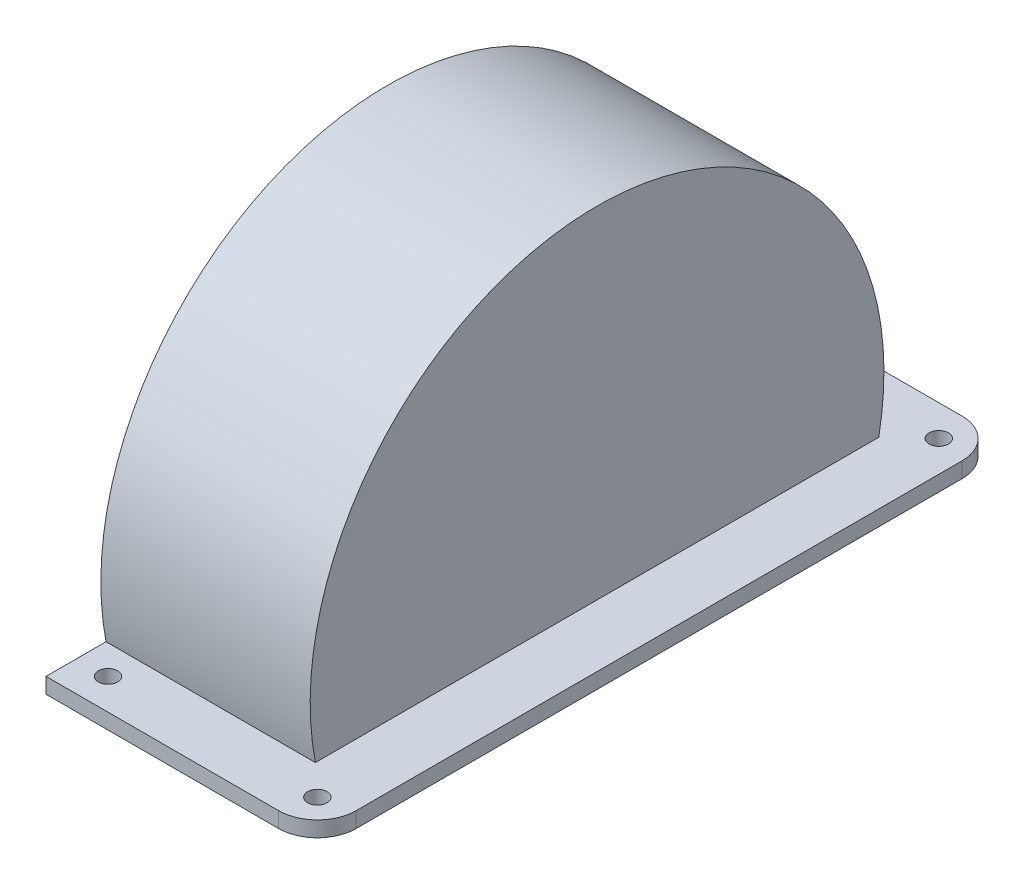
ISO-10303-21;
HEADER;
FILE_DESCRIPTION(('STEP AP214'),'2;1');
FILE_NAME('part.step','',(''),(''),'','','');
FILE_SCHEMA(('AUTOMOTIVE_DESIGN { 1 0 10303 214 1 1 1 1 }'));
ENDSEC;
DATA;
#1=APPLICATION_CONTEXT('core data for automotive mechanical design processes');
#2=APPLICATION_PROTOCOL_DEFINITION('international standard','automotive_design',2000,#1);
#3=PRODUCT_CONTEXT('',#1,'mechanical');
#4=PRODUCT('Part','Part','',(#3));
#5=PRODUCT_RELATED_PRODUCT_CATEGORY('part','',(#4));
#6=PRODUCT_DEFINITION_FORMATION('','',#4);
#7=PRODUCT_DEFINITION_CONTEXT('part definition',#1,'design');
#8=PRODUCT_DEFINITION('design','',#6,#7);
#9=PRODUCT_DEFINITION_SHAPE('','',#8);
#10=(LENGTH_UNIT() NAMED_UNIT(*) SI_UNIT(.MILLI.,.METRE.));
#11=(NAMED_UNIT(*) PLANE_ANGLE_UNIT() SI_UNIT($,.RADIAN.));
#12=(NAMED_UNIT(*) SI_UNIT($,.STERADIAN.) SOLID_ANGLE_UNIT());
#13=UNCERTAINTY_MEASURE_WITH_UNIT(LENGTH_MEASURE(1.E-05),#10,'distance_accuracy_value','');
#14=(GEOMETRIC_REPRESENTATION_CONTEXT(3) GLOBAL_UNCERTAINTY_ASSIGNED_CONTEXT((#13)) GLOBAL_UNIT_ASSIGNED_CONTEXT((#10,
#11,#12)) REPRESENTATION_CONTEXT('',''));
#15=CARTESIAN_POINT('',(0.,0.,0.));
#16=DIRECTION('',(0.,0.,1.));
#17=DIRECTION('',(1.,0.,0.));
#18=AXIS2_PLACEMENT_3D('',#15,#16,#17);
#19=CARTESIAN_POINT('',(14.5,0.,0.));
#20=DIRECTION('',(-1.,0.,0.));
#21=DIRECTION('',(0.,0.,1.));
#22=AXIS2_PLACEMENT_3D('',#19,#20,#21);
#23=CYLINDRICAL_SURFACE('',#22,37.);
#24=DIRECTION('',(-1.,0.,0.));
#25=VECTOR('',#24,1.);
#26=CARTESIAN_POINT('',(14.5,-7.,-36.3318042491699));
#27=LINE('',#26,#25);
#28=CARTESIAN_POINT('',(14.5,-7.,-36.3318042491699));
#29=VERTEX_POINT('',#28);
#30=CARTESIAN_POINT('',(-12.5,-7.00000000000001,-36.3318042491699));
#31=VERTEX_POINT('',#30);
#32=EDGE_CURVE('E224',#29,#31,#27,.T.);
#33=ORIENTED_EDGE('',*,*,#32,.T.);
#34=CARTESIAN_POINT('',(-12.5,0.,0.));
#35=DIRECTION('',(1.,0.,0.));
#36=DIRECTION('',(0.,0.,-1.));
#37=AXIS2_PLACEMENT_3D('',#34,#35,#36);
#38=CIRCLE('',#37,37.);
#39=CARTESIAN_POINT('',(-12.5,-7.,36.3318042491699));
#40=VERTEX_POINT('',#39);
#41=EDGE_CURVE('E308',#31,#40,#38,.T.);
#42=ORIENTED_EDGE('',*,*,#41,.T.);
#43=DIRECTION('',(-1.,0.,0.));
#44=VECTOR('',#43,1.);
#45=CARTESIAN_POINT('',(14.5,-7.,36.3318042491699));
#46=LINE('',#45,#44);
#47=CARTESIAN_POINT('',(14.5,-7.,36.3318042491699));
#48=VERTEX_POINT('',#47);
#49=EDGE_CURVE('E221',#40,#48,#46,.F.);
#50=ORIENTED_EDGE('',*,*,#49,.T.);
#51=CARTESIAN_POINT('',(14.5,0.,0.));
#52=DIRECTION('',(1.,0.,0.));
#53=DIRECTION('',(0.,0.,-1.));
#54=AXIS2_PLACEMENT_3D('',#51,#52,#53);
#55=CIRCLE('',#54,37.);
#56=EDGE_CURVE('E235',#29,#48,#55,.T.);
#57=ORIENTED_EDGE('',*,*,#56,.F.);
#58=EDGE_LOOP('',(#33,#42,#50,#57));
#59=FACE_BOUND('',#58,.T.);
#60=ADVANCED_FACE('F39',(#59),#23,.T.);
#61=CARTESIAN_POINT('',(14.5,0.,0.));
#62=DIRECTION('',(1.,0.,0.));
#63=DIRECTION('',(0.,0.,-1.));
#64=AXIS2_PLACEMENT_3D('',#61,#62,#63);
#65=PLANE('',#64);
#66=DIRECTION('',(0.,0.,1.));
#67=VECTOR('',#66,1.);
#68=CARTESIAN_POINT('',(14.5,-7.,0.));
#69=LINE('',#68,#67);
#70=EDGE_CURVE('E54',#29,#48,#69,.T.);
#71=ORIENTED_EDGE('',*,*,#70,.F.);
#72=ORIENTED_EDGE('',*,*,#56,.T.);
#73=EDGE_LOOP('',(#71,#72));
#74=FACE_BOUND('',#73,.T.);
#75=ADVANCED_FACE('F361',(#74),#65,.T.);
#76=CARTESIAN_POINT('',(17.5,-7.,-39.0734500748016));
#77=DIRECTION('',(0.,1.,0.));
#78=DIRECTION('',(0.,0.,1.));
#79=AXIS2_PLACEMENT_3D('',#76,#77,#78);
#80=PLANE('',#79);
#81=DIRECTION('',(0.,0.,1.));
#82=VECTOR('',#81,1.);
#83=CARTESIAN_POINT('',(-12.5,-7.,44.0734500748016));
#84=LINE('',#83,#82);
#85=CARTESIAN_POINT('',(-12.5,-7.,44.0734500748016));
#86=VERTEX_POINT('',#85);
#87=EDGE_CURVE('E304',#40,#86,#84,.T.);
#88=ORIENTED_EDGE('',*,*,#87,.T.);
#89=DIRECTION('',(-1.,0.,0.));
#90=VECTOR('',#89,1.);
#91=CARTESIAN_POINT('',(-9.49999999999997,-7.,44.0734500748016));
#92=LINE('',#91,#90);
#93=CARTESIAN_POINT('',(17.5,-7.,44.0734500748016));
#94=VERTEX_POINT('',#93);
#95=EDGE_CURVE('E161',#94,#86,#92,.T.);
#96=ORIENTED_EDGE('',*,*,#95,.F.);
#97=CARTESIAN_POINT('',(17.5,-7.,39.0734500748016));
#98=DIRECTION('',(0.,-1.,0.));
#99=DIRECTION('',(0.,0.,1.));
#100=AXIS2_PLACEMENT_3D('',#97,#98,#99);
#101=CIRCLE('',#100,5.);
#102=CARTESIAN_POINT('',(22.5,-7.,39.0734500748016));
#103=VERTEX_POINT('',#102);
#104=EDGE_CURVE('E189',#103,#94,#101,.T.);
#105=ORIENTED_EDGE('',*,*,#104,.F.);
#106=DIRECTION('',(0.,0.,1.));
#107=VECTOR('',#106,1.);
#108=CARTESIAN_POINT('',(22.5,-7.,-39.0734500748016));
#109=LINE('',#108,#107);
#110=CARTESIAN_POINT('',(22.5,-7.,-39.0734500748016));
#111=VERTEX_POINT('',#110);
#112=EDGE_CURVE('E186',#111,#103,#109,.T.);
#113=ORIENTED_EDGE('',*,*,#112,.F.);
#114=CARTESIAN_POINT('',(17.5,-7.,-39.0734500748016));
#115=DIRECTION('',(0.,-1.,0.));
#116=DIRECTION('',(0.,0.,1.));
#117=AXIS2_PLACEMENT_3D('',#114,#115,#116);
#118=CIRCLE('',#117,5.);
#119=CARTESIAN_POINT('',(17.5,-7.,-44.0734500748016));
#120=VERTEX_POINT('',#119);
#121=EDGE_CURVE('E183',#120,#111,#118,.T.);
#122=ORIENTED_EDGE('',*,*,#121,.F.);
#123=DIRECTION('',(1.,0.,0.));
#124=VECTOR('',#123,1.);
#125=CARTESIAN_POINT('',(-9.49999999999997,-7.,-44.0734500748016));
#126=LINE('',#125,#124);
#127=CARTESIAN_POINT('',(-12.5,-7.,-44.0734500748016));
#128=VERTEX_POINT('',#127);
#129=EDGE_CURVE('E180',#128,#120,#126,.T.);
#130=ORIENTED_EDGE('',*,*,#129,.F.);
#131=DIRECTION('',(0.,0.,1.));
#132=VECTOR('',#131,1.);
#133=CARTESIAN_POINT('',(-12.5,-7.,-36.3318042491699));
#134=LINE('',#133,#132);
#135=EDGE_CURVE('E315',#128,#31,#134,.T.);
#136=ORIENTED_EDGE('',*,*,#135,.T.);
#137=ORIENTED_EDGE('',*,*,#32,.F.);
#138=ORIENTED_EDGE('',*,*,#70,.T.);
#139=ORIENTED_EDGE('',*,*,#49,.F.);
#140=EDGE_LOOP('',(#88,#96,#105,#113,#122,#130,#136,#137,#138,#139));
#141=FACE_BOUND('',#140,.T.);
#142=CARTESIAN_POINT('',(-8.50000000000001,-7.,-40.0734500748016));
#143=DIRECTION('',(0.,-1.,0.));
#144=DIRECTION('',(0.,0.,-1.));
#145=AXIS2_PLACEMENT_3D('',#142,#143,#144);
#146=CIRCLE('',#145,1.25);
#147=CARTESIAN_POINT('',(-8.50000000000001,-7.,-41.3234500748016));
#148=VERTEX_POINT('',#147);
#149=EDGE_CURVE('E307',#148,#148,#146,.T.);
#150=ORIENTED_EDGE('',*,*,#149,.T.);
#151=EDGE_LOOP('',(#150));
#152=FACE_BOUND('',#151,.T.);
#153=CARTESIAN_POINT('',(-8.50000000000001,-7.,40.0734500748016));
#154=DIRECTION('',(0.,-1.,0.));
#155=DIRECTION('',(0.,0.,-1.));
#156=AXIS2_PLACEMENT_3D('',#153,#154,#155);
#157=CIRCLE('',#156,1.25);
#158=CARTESIAN_POINT('',(-8.50000000000001,-7.,38.8234500748016));
#159=VERTEX_POINT('',#158);
#160=EDGE_CURVE('E327',#159,#159,#157,.T.);
#161=ORIENTED_EDGE('',*,*,#160,.T.);
#162=EDGE_LOOP('',(#161));
#163=FACE_BOUND('',#162,.T.);
#164=CARTESIAN_POINT('',(18.5,-7.,40.0734500748016));
#165=DIRECTION('',(0.,-1.,0.));
#166=DIRECTION('',(0.,0.,-1.));
#167=AXIS2_PLACEMENT_3D('',#164,#165,#166);
#168=CIRCLE('',#167,1.25);
#169=CARTESIAN_POINT('',(18.5,-7.,38.8234500748016));
#170=VERTEX_POINT('',#169);
#171=EDGE_CURVE('E335',#170,#170,#168,.T.);
#172=ORIENTED_EDGE('',*,*,#171,.T.);
#173=EDGE_LOOP('',(#172));
#174=FACE_BOUND('',#173,.T.);
#175=CARTESIAN_POINT('',(18.5,-7.,-40.0734500748016));
#176=DIRECTION('',(0.,-1.,0.));
#177=DIRECTION('',(0.,0.,-1.));
#178=AXIS2_PLACEMENT_3D('',#175,#176,#177);
#179=CIRCLE('',#178,1.25);
#180=CARTESIAN_POINT('',(18.5,-7.,-41.3234500748016));
#181=VERTEX_POINT('',#180);
#182=EDGE_CURVE('E321',#181,#181,#179,.T.);
#183=ORIENTED_EDGE('',*,*,#182,.T.);
#184=EDGE_LOOP('',(#183));
#185=FACE_BOUND('',#184,.T.);
#186=ADVANCED_FACE('F300',(#141,#152,#163,#174,#185),#80,.T.);
#187=DIRECTION('',(0.,0.,1.));
#188=VECTOR('',#187,1.);
#189=CARTESIAN_POINT('',(12.5,-7.,0.));
#190=LINE('',#189,#188);
#191=CARTESIAN_POINT('',(12.5,-7.,-34.2928563989645));
#192=VERTEX_POINT('',#191);
#193=CARTESIAN_POINT('',(12.5,-7.,-34.0734500748016));
#194=VERTEX_POINT('',#193);
#195=EDGE_CURVE('E215',#192,#194,#190,.T.);
#196=ORIENTED_EDGE('',*,*,#195,.F.);
#197=DIRECTION('',(-1.,0.,0.));
#198=VECTOR('',#197,1.);
#199=CARTESIAN_POINT('',(14.5,-7.,-34.2928563989645));
#200=LINE('',#199,#198);
#201=CARTESIAN_POINT('',(-12.5,-7.,-34.2928563989645));
#202=VERTEX_POINT('',#201);
#203=EDGE_CURVE('E214',#192,#202,#200,.T.);
#204=ORIENTED_EDGE('',*,*,#203,.T.);
#205=DIRECTION('',(0.,0.,1.));
#206=VECTOR('',#205,1.);
#207=CARTESIAN_POINT('',(-12.5,-7.,0.));
#208=LINE('',#207,#206);
#209=CARTESIAN_POINT('',(-12.5,-7.,-34.0734500748016));
#210=VERTEX_POINT('',#209);
#211=EDGE_CURVE('E11',#202,#210,#208,.T.);
#212=ORIENTED_EDGE('',*,*,#211,.T.);
#213=DIRECTION('',(1.,0.,0.));
#214=VECTOR('',#213,1.);
#215=CARTESIAN_POINT('',(-12.5,-7.,-34.0734500748016));
#216=LINE('',#215,#214);
#217=EDGE_CURVE('E265',#210,#194,#216,.T.);
#218=ORIENTED_EDGE('',*,*,#217,.T.);
#219=EDGE_LOOP('',(#196,#204,#212,#218));
#220=FACE_BOUND('',#219,.T.);
#221=ADVANCED_FACE('F264',(#220),#80,.T.);
#222=CARTESIAN_POINT('',(12.5,-7.,34.0734500748016));
#223=VERTEX_POINT('',#222);
#224=CARTESIAN_POINT('',(12.5,-7.,34.2928563989645));
#225=VERTEX_POINT('',#224);
#226=EDGE_CURVE('E211',#223,#225,#190,.T.);
#227=ORIENTED_EDGE('',*,*,#226,.F.);
#228=DIRECTION('',(-1.,0.,0.));
#229=VECTOR('',#228,1.);
#230=CARTESIAN_POINT('',(-12.5,-7.,34.0734500748016));
#231=LINE('',#230,#229);
#232=CARTESIAN_POINT('',(-12.5,-7.,34.0734500748016));
#233=VERTEX_POINT('',#232);
#234=EDGE_CURVE('E253',#223,#233,#231,.T.);
#235=ORIENTED_EDGE('',*,*,#234,.T.);
#236=CARTESIAN_POINT('',(-12.5,-7.,34.2928563989645));
#237=VERTEX_POINT('',#236);
#238=EDGE_CURVE('E48',#233,#237,#208,.T.);
#239=ORIENTED_EDGE('',*,*,#238,.T.);
#240=DIRECTION('',(-1.,0.,0.));
#241=VECTOR('',#240,1.);
#242=CARTESIAN_POINT('',(14.5,-7.,34.2928563989645));
#243=LINE('',#242,#241);
#244=EDGE_CURVE('E207',#237,#225,#243,.F.);
#245=ORIENTED_EDGE('',*,*,#244,.T.);
#246=EDGE_LOOP('',(#227,#235,#239,#245));
#247=FACE_BOUND('',#246,.T.);
#248=ADVANCED_FACE('F251',(#247),#80,.T.);
#249=CARTESIAN_POINT('',(-12.5,-9.,34.0734500748016));
#250=DIRECTION('',(0.,0.,-1.));
#251=DIRECTION('',(-1.,0.,0.));
#252=AXIS2_PLACEMENT_3D('',#249,#250,#251);
#253=PLANE('',#252);
#254=DIRECTION('',(-1.,0.,0.));
#255=VECTOR('',#254,1.);
#256=CARTESIAN_POINT('',(-12.5,-9.,34.0734500748016));
#257=LINE('',#256,#255);
#258=CARTESIAN_POINT('',(12.5,-9.,34.0734500748016));
#259=VERTEX_POINT('',#258);
#260=CARTESIAN_POINT('',(-12.5,-9.,34.0734500748016));
#261=VERTEX_POINT('',#260);
#262=EDGE_CURVE('E272',#259,#261,#257,.T.);
#263=ORIENTED_EDGE('',*,*,#262,.T.);
#264=DIRECTION('',(0.,1.,0.));
#265=VECTOR('',#264,1.);
#266=CARTESIAN_POINT('',(-12.5,0.,34.0734500748016));
#267=LINE('',#266,#265);
#268=EDGE_CURVE('E42',#261,#233,#267,.T.);
#269=ORIENTED_EDGE('',*,*,#268,.T.);
#270=ORIENTED_EDGE('',*,*,#234,.F.);
#271=DIRECTION('',(0.,1.,0.));
#272=VECTOR('',#271,1.);
#273=CARTESIAN_POINT('',(12.5,-9.,34.0734500748016));
#274=LINE('',#273,#272);
#275=EDGE_CURVE('E62',#259,#223,#274,.T.);
#276=ORIENTED_EDGE('',*,*,#275,.F.);
#277=EDGE_LOOP('',(#263,#269,#270,#276));
#278=FACE_BOUND('',#277,.T.);
#279=ADVANCED_FACE('F350',(#278),#253,.T.);
#280=CARTESIAN_POINT('',(-12.5,-9.,-34.0734500748016));
#281=DIRECTION('',(0.,0.,1.));
#282=DIRECTION('',(1.,0.,0.));
#283=AXIS2_PLACEMENT_3D('',#280,#281,#282);
#284=PLANE('',#283);
#285=DIRECTION('',(0.,1.,0.));
#286=VECTOR('',#285,1.);
#287=CARTESIAN_POINT('',(12.5,-9.,-34.0734500748016));
#288=LINE('',#287,#286);
#289=CARTESIAN_POINT('',(12.5,-9.,-34.0734500748016));
#290=VERTEX_POINT('',#289);
#291=EDGE_CURVE('E278',#290,#194,#288,.T.);
#292=ORIENTED_EDGE('',*,*,#291,.T.);
#293=ORIENTED_EDGE('',*,*,#217,.F.);
#294=DIRECTION('',(0.,-1.,0.));
#295=VECTOR('',#294,1.);
#296=CARTESIAN_POINT('',(-12.5,0.,-34.0734500748016));
#297=LINE('',#296,#295);
#298=CARTESIAN_POINT('',(-12.5,-9.,-34.0734500748016));
#299=VERTEX_POINT('',#298);
#300=EDGE_CURVE('E238',#210,#299,#297,.T.);
#301=ORIENTED_EDGE('',*,*,#300,.T.);
#302=DIRECTION('',(1.,0.,0.));
#303=VECTOR('',#302,1.);
#304=CARTESIAN_POINT('',(-12.5,-9.,-34.0734500748016));
#305=LINE('',#304,#303);
#306=EDGE_CURVE('E281',#299,#290,#305,.T.);
#307=ORIENTED_EDGE('',*,*,#306,.T.);
#308=EDGE_LOOP('',(#292,#293,#301,#307));
#309=FACE_BOUND('',#308,.T.);
#310=ADVANCED_FACE('F347',(#309),#284,.T.);
#311=CARTESIAN_POINT('',(17.5,-9.,-39.0734500748016));
#312=DIRECTION('',(0.,1.,0.));
#313=DIRECTION('',(0.,0.,1.));
#314=AXIS2_PLACEMENT_3D('',#311,#312,#313);
#315=PLANE('',#314);
#316=DIRECTION('',(-1.,0.,0.));
#317=VECTOR('',#316,1.);
#318=CARTESIAN_POINT('',(-9.49999999999997,-9.,44.0734500748016));
#319=LINE('',#318,#317);
#320=CARTESIAN_POINT('',(17.5,-9.,44.0734500748016));
#321=VERTEX_POINT('',#320);
#322=CARTESIAN_POINT('',(-12.5,-9.,44.0734500748016));
#323=VERTEX_POINT('',#322);
#324=EDGE_CURVE('E160',#321,#323,#319,.T.);
#325=ORIENTED_EDGE('',*,*,#324,.T.);
#326=DIRECTION('',(0.,0.,-1.));
#327=VECTOR('',#326,1.);
#328=CARTESIAN_POINT('',(-12.5,-9.,-44.0734500748016));
#329=LINE('',#328,#327);
#330=EDGE_CURVE('E141',#323,#261,#329,.T.);
#331=ORIENTED_EDGE('',*,*,#330,.T.);
#332=ORIENTED_EDGE('',*,*,#262,.F.);
#333=DIRECTION('',(0.,0.,1.));
#334=VECTOR('',#333,1.);
#335=CARTESIAN_POINT('',(12.5,-9.,-34.0734500748016));
#336=LINE('',#335,#334);
#337=EDGE_CURVE('E268',#290,#259,#336,.T.);
#338=ORIENTED_EDGE('',*,*,#337,.F.);
#339=ORIENTED_EDGE('',*,*,#306,.F.);
#340=CARTESIAN_POINT('',(-12.5,-9.,-44.0734500748016));
#341=VERTEX_POINT('',#340);
#342=EDGE_CURVE('E153',#299,#341,#329,.T.);
#343=ORIENTED_EDGE('',*,*,#342,.T.);
#344=DIRECTION('',(1.,0.,0.));
#345=VECTOR('',#344,1.);
#346=CARTESIAN_POINT('',(-9.49999999999997,-9.,-44.0734500748016));
#347=LINE('',#346,#345);
#348=CARTESIAN_POINT('',(17.5,-9.,-44.0734500748016));
#349=VERTEX_POINT('',#348);
#350=EDGE_CURVE('E194',#341,#349,#347,.T.);
#351=ORIENTED_EDGE('',*,*,#350,.T.);
#352=CARTESIAN_POINT('',(17.5,-9.,-39.0734500748016));
#353=DIRECTION('',(0.,-1.,0.));
#354=DIRECTION('',(0.,0.,1.));
#355=AXIS2_PLACEMENT_3D('',#352,#353,#354);
#356=CIRCLE('',#355,5.);
#357=CARTESIAN_POINT('',(22.5,-9.,-39.0734500748016));
#358=VERTEX_POINT('',#357);
#359=EDGE_CURVE('E286',#349,#358,#356,.T.);
#360=ORIENTED_EDGE('',*,*,#359,.T.);
#361=DIRECTION('',(0.,0.,1.));
#362=VECTOR('',#361,1.);
#363=CARTESIAN_POINT('',(22.5,-9.,-39.0734500748016));
#364=LINE('',#363,#362);
#365=CARTESIAN_POINT('',(22.5,-9.,39.0734500748016));
#366=VERTEX_POINT('',#365);
#367=EDGE_CURVE('E176',#358,#366,#364,.T.);
#368=ORIENTED_EDGE('',*,*,#367,.T.);
#369=CARTESIAN_POINT('',(17.5,-9.,39.0734500748016));
#370=DIRECTION('',(0.,-1.,0.));
#371=DIRECTION('',(0.,0.,1.));
#372=AXIS2_PLACEMENT_3D('',#369,#370,#371);
#373=CIRCLE('',#372,5.);
#374=EDGE_CURVE('E167',#366,#321,#373,.T.);
#375=ORIENTED_EDGE('',*,*,#374,.T.);
#376=EDGE_LOOP('',(#325,#331,#332,#338,#339,#343,#351,#360,#368,#375));
#377=FACE_BOUND('',#376,.T.);
#378=CARTESIAN_POINT('',(18.5,-9.,40.0734500748016));
#379=DIRECTION('',(0.,-1.,0.));
#380=DIRECTION('',(0.,0.,-1.));
#381=AXIS2_PLACEMENT_3D('',#378,#379,#380);
#382=CIRCLE('',#381,1.25);
#383=CARTESIAN_POINT('',(18.5,-9.,38.8234500748016));
#384=VERTEX_POINT('',#383);
#385=EDGE_CURVE('E274',#384,#384,#382,.T.);
#386=ORIENTED_EDGE('',*,*,#385,.F.);
#387=EDGE_LOOP('',(#386));
#388=FACE_BOUND('',#387,.T.);
#389=CARTESIAN_POINT('',(-8.50000000000001,-9.,40.0734500748016));
#390=DIRECTION('',(0.,-1.,0.));
#391=DIRECTION('',(0.,0.,-1.));
#392=AXIS2_PLACEMENT_3D('',#389,#390,#391);
#393=CIRCLE('',#392,1.25);
#394=CARTESIAN_POINT('',(-8.50000000000001,-9.,38.8234500748016));
#395=VERTEX_POINT('',#394);
#396=EDGE_CURVE('E331',#395,#395,#393,.T.);
#397=ORIENTED_EDGE('',*,*,#396,.F.);
#398=EDGE_LOOP('',(#397));
#399=FACE_BOUND('',#398,.T.);
#400=CARTESIAN_POINT('',(18.5,-9.,-40.0734500748016));
#401=DIRECTION('',(0.,-1.,0.));
#402=DIRECTION('',(0.,0.,-1.));
#403=AXIS2_PLACEMENT_3D('',#400,#401,#402);
#404=CIRCLE('',#403,1.25);
#405=CARTESIAN_POINT('',(18.5,-9.,-41.3234500748016));
#406=VERTEX_POINT('',#405);
#407=EDGE_CURVE('E323',#406,#406,#404,.T.);
#408=ORIENTED_EDGE('',*,*,#407,.F.);
#409=EDGE_LOOP('',(#408));
#410=FACE_BOUND('',#409,.T.);
#411=CARTESIAN_POINT('',(-8.50000000000001,-9.,-40.0734500748016));
#412=DIRECTION('',(0.,-1.,0.));
#413=DIRECTION('',(0.,0.,-1.));
#414=AXIS2_PLACEMENT_3D('',#411,#412,#413);
#415=CIRCLE('',#414,1.25);
#416=CARTESIAN_POINT('',(-8.50000000000001,-9.,-41.3234500748016));
#417=VERTEX_POINT('',#416);
#418=EDGE_CURVE('E313',#417,#417,#415,.T.);
#419=ORIENTED_EDGE('',*,*,#418,.F.);
#420=EDGE_LOOP('',(#419));
#421=FACE_BOUND('',#420,.T.);
#422=ADVANCED_FACE('F164',(#377,#388,#399,#410,#421),#315,.F.);
#423=CARTESIAN_POINT('',(-9.49999999999997,-9.,-44.0734500748016));
#424=DIRECTION('',(0.,0.,1.));
#425=DIRECTION('',(1.,0.,0.));
#426=AXIS2_PLACEMENT_3D('',#423,#424,#425);
#427=PLANE('',#426);
#428=ORIENTED_EDGE('',*,*,#350,.F.);
#429=DIRECTION('',(0.,1.,0.));
#430=VECTOR('',#429,1.);
#431=CARTESIAN_POINT('',(-12.5,-7.,-44.0734500748016));
#432=LINE('',#431,#430);
#433=EDGE_CURVE('E152',#341,#128,#432,.T.);
#434=ORIENTED_EDGE('',*,*,#433,.T.);
#435=ORIENTED_EDGE('',*,*,#129,.T.);
#436=DIRECTION('',(0.,1.,0.));
#437=VECTOR('',#436,1.);
#438=CARTESIAN_POINT('',(17.5,-9.,-44.0734500748016));
#439=LINE('',#438,#437);
#440=EDGE_CURVE('E203',#349,#120,#439,.T.);
#441=ORIENTED_EDGE('',*,*,#440,.F.);
#442=EDGE_LOOP('',(#428,#434,#435,#441));
#443=FACE_BOUND('',#442,.T.);
#444=ADVANCED_FACE('F375',(#443),#427,.F.);
#445=CARTESIAN_POINT('',(17.5,-9.,-39.0734500748016));
#446=DIRECTION('',(0.,1.,0.));
#447=DIRECTION('',(0.,0.,1.));
#448=AXIS2_PLACEMENT_3D('',#445,#446,#447);
#449=CYLINDRICAL_SURFACE('',#448,5.);
#450=ORIENTED_EDGE('',*,*,#121,.T.);
#451=DIRECTION('',(0.,1.,0.));
#452=VECTOR('',#451,1.);
#453=CARTESIAN_POINT('',(22.5,-9.,-39.0734500748016));
#454=LINE('',#453,#452);
#455=EDGE_CURVE('E199',#358,#111,#454,.T.);
#456=ORIENTED_EDGE('',*,*,#455,.F.);
#457=ORIENTED_EDGE('',*,*,#359,.F.);
#458=ORIENTED_EDGE('',*,*,#440,.T.);
#459=EDGE_LOOP('',(#450,#456,#457,#458));
#460=FACE_BOUND('',#459,.T.);
#461=ADVANCED_FACE('F379',(#460),#449,.T.);
#462=CARTESIAN_POINT('',(22.5,-9.,-39.0734500748016));
#463=DIRECTION('',(-1.,0.,0.));
#464=DIRECTION('',(0.,0.,1.));
#465=AXIS2_PLACEMENT_3D('',#462,#463,#464);
#466=PLANE('',#465);
#467=ORIENTED_EDGE('',*,*,#112,.T.);
#468=DIRECTION('',(0.,1.,0.));
#469=VECTOR('',#468,1.);
#470=CARTESIAN_POINT('',(22.5,-9.,39.0734500748016));
#471=LINE('',#470,#469);
#472=EDGE_CURVE('E174',#366,#103,#471,.T.);
#473=ORIENTED_EDGE('',*,*,#472,.F.);
#474=ORIENTED_EDGE('',*,*,#367,.F.);
#475=ORIENTED_EDGE('',*,*,#455,.T.);
#476=EDGE_LOOP('',(#467,#473,#474,#475));
#477=FACE_BOUND('',#476,.T.);
#478=ADVANCED_FACE('F294',(#477),#466,.F.);
#479=CARTESIAN_POINT('',(17.5,-9.,39.0734500748016));
#480=DIRECTION('',(0.,1.,0.));
#481=DIRECTION('',(0.,0.,1.));
#482=AXIS2_PLACEMENT_3D('',#479,#480,#481);
#483=CYLINDRICAL_SURFACE('',#482,5.);
#484=ORIENTED_EDGE('',*,*,#104,.T.);
#485=DIRECTION('',(0.,1.,0.));
#486=VECTOR('',#485,1.);
#487=CARTESIAN_POINT('',(17.5,-9.,44.0734500748016));
#488=LINE('',#487,#486);
#489=EDGE_CURVE('E170',#321,#94,#488,.T.);
#490=ORIENTED_EDGE('',*,*,#489,.F.);
#491=ORIENTED_EDGE('',*,*,#374,.F.);
#492=ORIENTED_EDGE('',*,*,#472,.T.);
#493=EDGE_LOOP('',(#484,#490,#491,#492));
#494=FACE_BOUND('',#493,.T.);
#495=ADVANCED_FACE('F298',(#494),#483,.T.);
#496=CARTESIAN_POINT('',(-9.49999999999997,-9.,44.0734500748016));
#497=DIRECTION('',(0.,0.,-1.));
#498=DIRECTION('',(-1.,0.,0.));
#499=AXIS2_PLACEMENT_3D('',#496,#497,#498);
#500=PLANE('',#499);
#501=ORIENTED_EDGE('',*,*,#95,.T.);
#502=DIRECTION('',(0.,-1.,0.));
#503=VECTOR('',#502,1.);
#504=CARTESIAN_POINT('',(-12.5,-9.,44.0734500748016));
#505=LINE('',#504,#503);
#506=EDGE_CURVE('E144',#86,#323,#505,.T.);
#507=ORIENTED_EDGE('',*,*,#506,.T.);
#508=ORIENTED_EDGE('',*,*,#324,.F.);
#509=ORIENTED_EDGE('',*,*,#489,.T.);
#510=EDGE_LOOP('',(#501,#507,#508,#509));
#511=FACE_BOUND('',#510,.T.);
#512=ADVANCED_FACE('F158',(#511),#500,.F.);
#513=CARTESIAN_POINT('',(18.5,-9.,40.0734500748016));
#514=DIRECTION('',(0.,1.,0.));
#515=DIRECTION('',(0.,0.,1.));
#516=AXIS2_PLACEMENT_3D('',#513,#514,#515);
#517=CYLINDRICAL_SURFACE('',#516,1.25);
#518=ORIENTED_EDGE('',*,*,#385,.T.);
#519=EDGE_LOOP('',(#518));
#520=FACE_BOUND('',#519,.T.);
#521=ORIENTED_EDGE('',*,*,#171,.F.);
#522=EDGE_LOOP('',(#521));
#523=FACE_BOUND('',#522,.T.);
#524=ADVANCED_FACE('F411',(#520,#523),#517,.F.);
#525=CARTESIAN_POINT('',(-8.50000000000001,-9.,40.0734500748016));
#526=DIRECTION('',(0.,1.,0.));
#527=DIRECTION('',(0.,0.,1.));
#528=AXIS2_PLACEMENT_3D('',#525,#526,#527);
#529=CYLINDRICAL_SURFACE('',#528,1.25);
#530=ORIENTED_EDGE('',*,*,#396,.T.);
#531=EDGE_LOOP('',(#530));
#532=FACE_BOUND('',#531,.T.);
#533=ORIENTED_EDGE('',*,*,#160,.F.);
#534=EDGE_LOOP('',(#533));
#535=FACE_BOUND('',#534,.T.);
#536=ADVANCED_FACE('F403',(#532,#535),#529,.F.);
#537=CARTESIAN_POINT('',(18.5,-9.,-40.0734500748016));
#538=DIRECTION('',(0.,1.,0.));
#539=DIRECTION('',(0.,0.,1.));
#540=AXIS2_PLACEMENT_3D('',#537,#538,#539);
#541=CYLINDRICAL_SURFACE('',#540,1.25);
#542=ORIENTED_EDGE('',*,*,#407,.T.);
#543=EDGE_LOOP('',(#542));
#544=FACE_BOUND('',#543,.T.);
#545=ORIENTED_EDGE('',*,*,#182,.F.);
#546=EDGE_LOOP('',(#545));
#547=FACE_BOUND('',#546,.T.);
#548=ADVANCED_FACE('F397',(#544,#547),#541,.F.);
#549=CARTESIAN_POINT('',(-8.50000000000001,-9.,-40.0734500748016));
#550=DIRECTION('',(0.,1.,0.));
#551=DIRECTION('',(0.,0.,1.));
#552=AXIS2_PLACEMENT_3D('',#549,#550,#551);
#553=CYLINDRICAL_SURFACE('',#552,1.25);
#554=ORIENTED_EDGE('',*,*,#418,.T.);
#555=EDGE_LOOP('',(#554));
#556=FACE_BOUND('',#555,.T.);
#557=ORIENTED_EDGE('',*,*,#149,.F.);
#558=EDGE_LOOP('',(#557));
#559=FACE_BOUND('',#558,.T.);
#560=ADVANCED_FACE('F393',(#556,#559),#553,.F.);
#561=CARTESIAN_POINT('',(12.5,0.,0.));
#562=DIRECTION('',(1.,0.,0.));
#563=DIRECTION('',(0.,0.,-1.));
#564=AXIS2_PLACEMENT_3D('',#561,#562,#563);
#565=PLANE('',#564);
#566=ORIENTED_EDGE('',*,*,#195,.T.);
#567=ORIENTED_EDGE('',*,*,#291,.F.);
#568=ORIENTED_EDGE('',*,*,#337,.T.);
#569=ORIENTED_EDGE('',*,*,#275,.T.);
#570=ORIENTED_EDGE('',*,*,#226,.T.);
#571=CARTESIAN_POINT('',(12.5,0.,0.));
#572=DIRECTION('',(1.,0.,0.));
#573=DIRECTION('',(0.,0.,-1.));
#574=AXIS2_PLACEMENT_3D('',#571,#572,#573);
#575=CIRCLE('',#574,35.);
#576=EDGE_CURVE('E231',#192,#225,#575,.T.);
#577=ORIENTED_EDGE('',*,*,#576,.F.);
#578=EDGE_LOOP('',(#566,#567,#568,#569,#570,#577));
#579=FACE_BOUND('',#578,.T.);
#580=ADVANCED_FACE('F260',(#579),#565,.F.);
#581=CARTESIAN_POINT('',(14.5,0.,0.));
#582=DIRECTION('',(-1.,0.,0.));
#583=DIRECTION('',(0.,0.,1.));
#584=AXIS2_PLACEMENT_3D('',#581,#582,#583);
#585=CYLINDRICAL_SURFACE('',#584,35.);
#586=ORIENTED_EDGE('',*,*,#203,.F.);
#587=ORIENTED_EDGE('',*,*,#576,.T.);
#588=ORIENTED_EDGE('',*,*,#244,.F.);
#589=CARTESIAN_POINT('',(-12.5,0.,0.));
#590=DIRECTION('',(1.,0.,0.));
#591=DIRECTION('',(0.,0.,-1.));
#592=AXIS2_PLACEMENT_3D('',#589,#590,#591);
#593=CIRCLE('',#592,35.);
#594=EDGE_CURVE('E228',#202,#237,#593,.T.);
#595=ORIENTED_EDGE('',*,*,#594,.F.);
#596=EDGE_LOOP('',(#586,#587,#588,#595));
#597=FACE_BOUND('',#596,.T.);
#598=ADVANCED_FACE('F256',(#597),#585,.F.);
#599=CARTESIAN_POINT('',(-12.5,0.,0.));
#600=DIRECTION('',(1.,0.,0.));
#601=DIRECTION('',(0.,0.,-1.));
#602=AXIS2_PLACEMENT_3D('',#599,#600,#601);
#603=PLANE('',#602);
#604=ORIENTED_EDGE('',*,*,#268,.F.);
#605=ORIENTED_EDGE('',*,*,#330,.F.);
#606=ORIENTED_EDGE('',*,*,#506,.F.);
#607=ORIENTED_EDGE('',*,*,#87,.F.);
#608=ORIENTED_EDGE('',*,*,#41,.F.);
#609=ORIENTED_EDGE('',*,*,#135,.F.);
#610=ORIENTED_EDGE('',*,*,#433,.F.);
#611=ORIENTED_EDGE('',*,*,#342,.F.);
#612=ORIENTED_EDGE('',*,*,#300,.F.);
#613=ORIENTED_EDGE('',*,*,#211,.F.);
#614=ORIENTED_EDGE('',*,*,#594,.T.);
#615=ORIENTED_EDGE('',*,*,#238,.F.);
#616=EDGE_LOOP('',(#604,#605,#606,#607,#608,#609,#610,#611,#612,#613,#614,#615));
#617=FACE_BOUND('',#616,.T.);
#618=ADVANCED_FACE('F143',(#617),#603,.F.);
#619=CLOSED_SHELL('',(#60,#75,#186,#221,#248,#279,#310,#422,#444,#461,#478,#495,#512,#524,#536,
#548,#560,#580,#598,#618));
#620=MANIFOLD_SOLID_BREP('B2',#619);
#621=ADVANCED_BREP_SHAPE_REPRESENTATION('',(#18,#620),#14);
#622=SHAPE_DEFINITION_REPRESENTATION(#9,#621);
ENDSEC;
END-ISO-10303-21;
